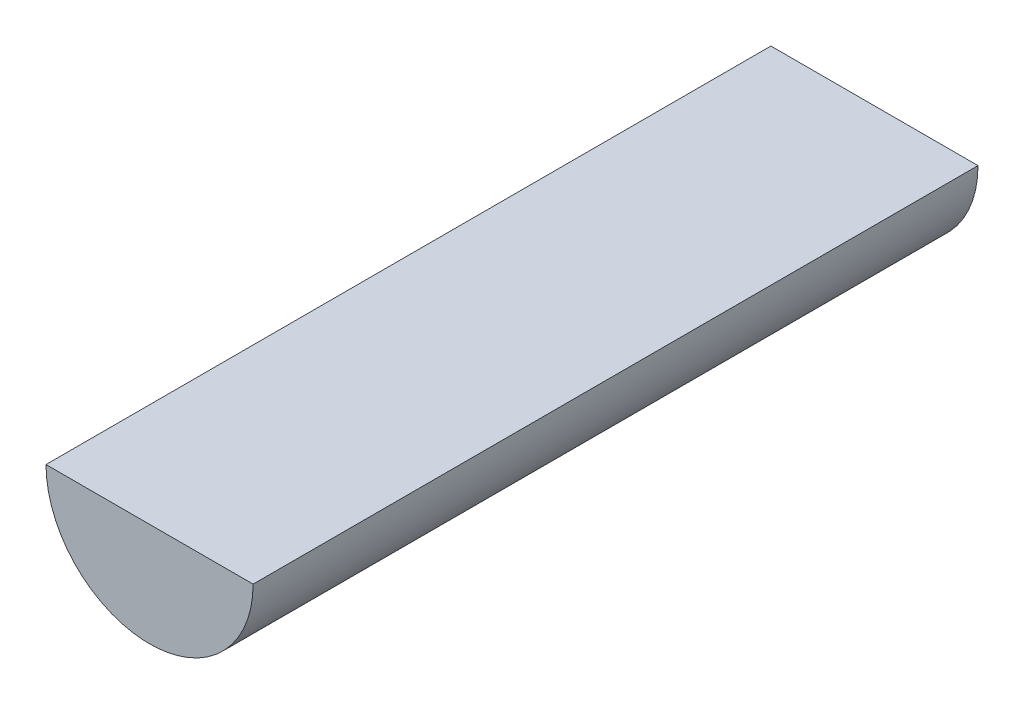
ISO-10303-21;
HEADER;
FILE_DESCRIPTION(('STEP AP214'),'2;1');
FILE_NAME('part.step','',(''),(''),'','','');
FILE_SCHEMA(('AUTOMOTIVE_DESIGN { 1 0 10303 214 1 1 1 1 }'));
ENDSEC;
DATA;
#1=APPLICATION_CONTEXT('core data for automotive mechanical design processes');
#2=APPLICATION_PROTOCOL_DEFINITION('international standard','automotive_design',2000,#1);
#3=PRODUCT_CONTEXT('',#1,'mechanical');
#4=PRODUCT('Part','Part','',(#3));
#5=PRODUCT_RELATED_PRODUCT_CATEGORY('part','',(#4));
#6=PRODUCT_DEFINITION_FORMATION('','',#4);
#7=PRODUCT_DEFINITION_CONTEXT('part definition',#1,'design');
#8=PRODUCT_DEFINITION('design','',#6,#7);
#9=PRODUCT_DEFINITION_SHAPE('','',#8);
#10=(LENGTH_UNIT() NAMED_UNIT(*) SI_UNIT(.MILLI.,.METRE.));
#11=(NAMED_UNIT(*) PLANE_ANGLE_UNIT() SI_UNIT($,.RADIAN.));
#12=(NAMED_UNIT(*) SI_UNIT($,.STERADIAN.) SOLID_ANGLE_UNIT());
#13=UNCERTAINTY_MEASURE_WITH_UNIT(LENGTH_MEASURE(1.E-05),#10,'distance_accuracy_value','');
#14=(GEOMETRIC_REPRESENTATION_CONTEXT(3) GLOBAL_UNCERTAINTY_ASSIGNED_CONTEXT((#13)) GLOBAL_UNIT_ASSIGNED_CONTEXT((#10,
#11,#12)) REPRESENTATION_CONTEXT('',''));
#15=CARTESIAN_POINT('',(0.,0.,0.));
#16=DIRECTION('',(0.,0.,1.));
#17=DIRECTION('',(1.,0.,0.));
#18=AXIS2_PLACEMENT_3D('',#15,#16,#17);
#19=CARTESIAN_POINT('',(0.,0.,711.2));
#20=DIRECTION('',(0.,0.,-1.));
#21=DIRECTION('',(-1.,0.,0.));
#22=AXIS2_PLACEMENT_3D('',#19,#20,#21);
#23=CYLINDRICAL_SURFACE('',#22,101.6);
#24=CARTESIAN_POINT('',(0.,0.,0.));
#25=DIRECTION('',(0.,0.,1.));
#26=DIRECTION('',(1.,0.,0.));
#27=AXIS2_PLACEMENT_3D('',#24,#25,#26);
#28=CIRCLE('',#27,101.6);
#29=CARTESIAN_POINT('',(-101.6,0.,0.));
#30=VERTEX_POINT('',#29);
#31=CARTESIAN_POINT('',(101.6,0.,0.));
#32=VERTEX_POINT('',#31);
#33=EDGE_CURVE('E71',#30,#32,#28,.T.);
#34=ORIENTED_EDGE('',*,*,#33,.T.);
#35=DIRECTION('',(0.,0.,-1.));
#36=VECTOR('',#35,1.);
#37=CARTESIAN_POINT('',(101.6,0.,711.2));
#38=LINE('',#37,#36);
#39=CARTESIAN_POINT('',(101.6,0.,711.2));
#40=VERTEX_POINT('',#39);
#41=EDGE_CURVE('E11',#40,#32,#38,.T.);
#42=ORIENTED_EDGE('',*,*,#41,.F.);
#43=CARTESIAN_POINT('',(0.,0.,711.2));
#44=DIRECTION('',(0.,0.,1.));
#45=DIRECTION('',(1.,0.,0.));
#46=AXIS2_PLACEMENT_3D('',#43,#44,#45);
#47=CIRCLE('',#46,101.6);
#48=CARTESIAN_POINT('',(-101.6,0.,711.2));
#49=VERTEX_POINT('',#48);
#50=EDGE_CURVE('E70',#49,#40,#47,.T.);
#51=ORIENTED_EDGE('',*,*,#50,.F.);
#52=DIRECTION('',(0.,0.,-1.));
#53=VECTOR('',#52,1.);
#54=CARTESIAN_POINT('',(-101.6,0.,711.2));
#55=LINE('',#54,#53);
#56=EDGE_CURVE('E48',#49,#30,#55,.T.);
#57=ORIENTED_EDGE('',*,*,#56,.T.);
#58=EDGE_LOOP('',(#34,#42,#51,#57));
#59=FACE_BOUND('',#58,.T.);
#60=ADVANCED_FACE('F40',(#59),#23,.T.);
#61=CARTESIAN_POINT('',(-101.6,0.,711.2));
#62=DIRECTION('',(0.,-1.,0.));
#63=DIRECTION('',(0.,0.,-1.));
#64=AXIS2_PLACEMENT_3D('',#61,#62,#63);
#65=PLANE('',#64);
#66=DIRECTION('',(-1.,0.,0.));
#67=VECTOR('',#66,1.);
#68=CARTESIAN_POINT('',(-101.6,0.,0.));
#69=LINE('',#68,#67);
#70=EDGE_CURVE('E63',#32,#30,#69,.T.);
#71=ORIENTED_EDGE('',*,*,#70,.T.);
#72=ORIENTED_EDGE('',*,*,#56,.F.);
#73=DIRECTION('',(-1.,0.,0.));
#74=VECTOR('',#73,1.);
#75=CARTESIAN_POINT('',(-101.6,0.,711.2));
#76=LINE('',#75,#74);
#77=EDGE_CURVE('E55',#40,#49,#76,.T.);
#78=ORIENTED_EDGE('',*,*,#77,.F.);
#79=ORIENTED_EDGE('',*,*,#41,.T.);
#80=EDGE_LOOP('',(#71,#72,#78,#79));
#81=FACE_BOUND('',#80,.T.);
#82=ADVANCED_FACE('F66',(#81),#65,.F.);
#83=CARTESIAN_POINT('',(0.,0.,711.2));
#84=DIRECTION('',(0.,0.,1.));
#85=DIRECTION('',(1.,0.,0.));
#86=AXIS2_PLACEMENT_3D('',#83,#84,#85);
#87=PLANE('',#86);
#88=ORIENTED_EDGE('',*,*,#50,.T.);
#89=ORIENTED_EDGE('',*,*,#77,.T.);
#90=EDGE_LOOP('',(#88,#89));
#91=FACE_BOUND('',#90,.T.);
#92=ADVANCED_FACE('F78',(#91),#87,.T.);
#93=CARTESIAN_POINT('',(0.,0.,0.));
#94=DIRECTION('',(0.,0.,1.));
#95=DIRECTION('',(1.,0.,0.));
#96=AXIS2_PLACEMENT_3D('',#93,#94,#95);
#97=PLANE('',#96);
#98=ORIENTED_EDGE('',*,*,#33,.F.);
#99=ORIENTED_EDGE('',*,*,#70,.F.);
#100=EDGE_LOOP('',(#98,#99));
#101=FACE_BOUND('',#100,.T.);
#102=ADVANCED_FACE('F74',(#101),#97,.F.);
#103=CLOSED_SHELL('',(#60,#82,#92,#102));
#104=MANIFOLD_SOLID_BREP('B2',#103);
#105=ADVANCED_BREP_SHAPE_REPRESENTATION('',(#18,#104),#14);
#106=SHAPE_DEFINITION_REPRESENTATION(#9,#105);
ENDSEC;
END-ISO-10303-21;
